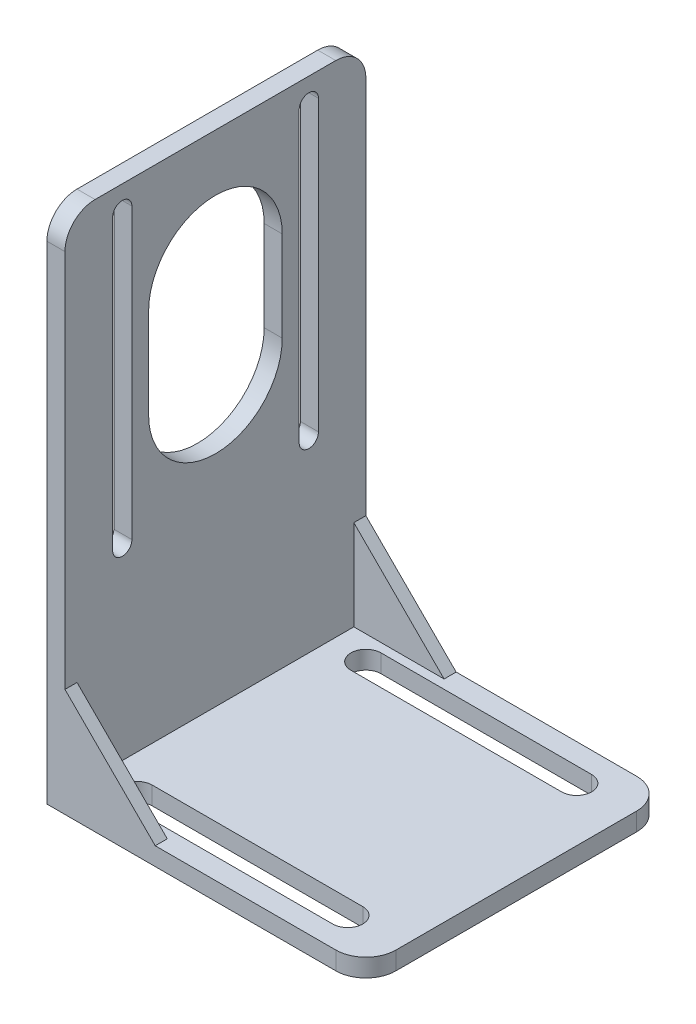
ISO-10303-21;
HEADER;
FILE_DESCRIPTION(('STEP AP214'),'2;1');
FILE_NAME('part.step','',(''),(''),'','','');
FILE_SCHEMA(('AUTOMOTIVE_DESIGN { 1 0 10303 214 1 1 1 1 }'));
ENDSEC;
DATA;
#1=APPLICATION_CONTEXT('core data for automotive mechanical design processes');
#2=APPLICATION_PROTOCOL_DEFINITION('international standard','automotive_design',2000,#1);
#3=PRODUCT_CONTEXT('',#1,'mechanical');
#4=PRODUCT('Part','Part','',(#3));
#5=PRODUCT_RELATED_PRODUCT_CATEGORY('part','',(#4));
#6=PRODUCT_DEFINITION_FORMATION('','',#4);
#7=PRODUCT_DEFINITION_CONTEXT('part definition',#1,'design');
#8=PRODUCT_DEFINITION('design','',#6,#7);
#9=PRODUCT_DEFINITION_SHAPE('','',#8);
#10=(LENGTH_UNIT() NAMED_UNIT(*) SI_UNIT(.MILLI.,.METRE.));
#11=(NAMED_UNIT(*) PLANE_ANGLE_UNIT() SI_UNIT($,.RADIAN.));
#12=(NAMED_UNIT(*) SI_UNIT($,.STERADIAN.) SOLID_ANGLE_UNIT());
#13=UNCERTAINTY_MEASURE_WITH_UNIT(LENGTH_MEASURE(1.E-05),#10,'distance_accuracy_value','');
#14=(GEOMETRIC_REPRESENTATION_CONTEXT(3) GLOBAL_UNCERTAINTY_ASSIGNED_CONTEXT((#13)) GLOBAL_UNIT_ASSIGNED_CONTEXT((#10,
#11,#12)) REPRESENTATION_CONTEXT('',''));
#15=CARTESIAN_POINT('',(0.,0.,0.));
#16=DIRECTION('',(0.,0.,1.));
#17=DIRECTION('',(1.,0.,0.));
#18=AXIS2_PLACEMENT_3D('',#15,#16,#17);
#19=CARTESIAN_POINT('',(26.5,3.,-25.));
#20=DIRECTION('',(-1.,0.,0.));
#21=DIRECTION('',(0.,0.,1.));
#22=AXIS2_PLACEMENT_3D('',#19,#20,#21);
#23=PLANE('',#22);
#24=DIRECTION('',(0.,0.,-1.));
#25=VECTOR('',#24,1.);
#26=CARTESIAN_POINT('',(26.5,3.,-25.));
#27=LINE('',#26,#25);
#28=CARTESIAN_POINT('',(26.5,3.,20.));
#29=VERTEX_POINT('',#28);
#30=CARTESIAN_POINT('',(26.5,3.,-20.));
#31=VERTEX_POINT('',#30);
#32=EDGE_CURVE('E505',#29,#31,#27,.T.);
#33=ORIENTED_EDGE('',*,*,#32,.F.);
#34=DIRECTION('',(0.,-1.,0.));
#35=VECTOR('',#34,1.);
#36=CARTESIAN_POINT('',(26.5,3.,20.));
#37=LINE('',#36,#35);
#38=CARTESIAN_POINT('',(26.5,0.,20.));
#39=VERTEX_POINT('',#38);
#40=EDGE_CURVE('E588',#29,#39,#37,.T.);
#41=ORIENTED_EDGE('',*,*,#40,.T.);
#42=DIRECTION('',(0.,0.,-1.));
#43=VECTOR('',#42,1.);
#44=CARTESIAN_POINT('',(26.5,0.,-25.));
#45=LINE('',#44,#43);
#46=CARTESIAN_POINT('',(26.5,0.,-20.));
#47=VERTEX_POINT('',#46);
#48=EDGE_CURVE('E453',#39,#47,#45,.T.);
#49=ORIENTED_EDGE('',*,*,#48,.T.);
#50=DIRECTION('',(0.,-1.,0.));
#51=VECTOR('',#50,1.);
#52=CARTESIAN_POINT('',(26.5,3.,-20.));
#53=LINE('',#52,#51);
#54=EDGE_CURVE('E585',#47,#31,#53,.F.);
#55=ORIENTED_EDGE('',*,*,#54,.T.);
#56=EDGE_LOOP('',(#33,#41,#49,#55));
#57=FACE_BOUND('',#56,.T.);
#58=ADVANCED_FACE('F39',(#57),#23,.F.);
#59=CARTESIAN_POINT('',(-26.5,3.,-25.));
#60=DIRECTION('',(0.,0.,1.));
#61=DIRECTION('',(1.,0.,0.));
#62=AXIS2_PLACEMENT_3D('',#59,#60,#61);
#63=PLANE('',#62);
#64=DIRECTION('',(-1.,0.,0.));
#65=VECTOR('',#64,1.);
#66=CARTESIAN_POINT('',(-26.5,3.,-25.));
#67=LINE('',#66,#65);
#68=CARTESIAN_POINT('',(21.5,3.,-25.));
#69=VERTEX_POINT('',#68);
#70=CARTESIAN_POINT('',(-8.5,3.,-25.));
#71=VERTEX_POINT('',#70);
#72=EDGE_CURVE('E509',#69,#71,#67,.T.);
#73=ORIENTED_EDGE('',*,*,#72,.F.);
#74=DIRECTION('',(0.,-1.,0.));
#75=VECTOR('',#74,1.);
#76=CARTESIAN_POINT('',(21.5,3.,-25.));
#77=LINE('',#76,#75);
#78=CARTESIAN_POINT('',(21.5,0.,-25.));
#79=VERTEX_POINT('',#78);
#80=EDGE_CURVE('E613',#69,#79,#77,.T.);
#81=ORIENTED_EDGE('',*,*,#80,.T.);
#82=DIRECTION('',(-1.,0.,0.));
#83=VECTOR('',#82,1.);
#84=CARTESIAN_POINT('',(-26.5,0.,-25.));
#85=LINE('',#84,#83);
#86=CARTESIAN_POINT('',(-26.5,0.,-25.));
#87=VERTEX_POINT('',#86);
#88=EDGE_CURVE('E521',#79,#87,#85,.T.);
#89=ORIENTED_EDGE('',*,*,#88,.T.);
#90=DIRECTION('',(0.,-1.,0.));
#91=VECTOR('',#90,1.);
#92=CARTESIAN_POINT('',(-26.5,3.,-25.));
#93=LINE('',#92,#91);
#94=CARTESIAN_POINT('',(-26.5,81.,-25.));
#95=VERTEX_POINT('',#94);
#96=EDGE_CURVE('E534',#95,#87,#93,.T.);
#97=ORIENTED_EDGE('',*,*,#96,.F.);
#98=DIRECTION('',(-1.,0.,0.));
#99=VECTOR('',#98,1.);
#100=CARTESIAN_POINT('',(-23.5,81.,-25.));
#101=LINE('',#100,#99);
#102=CARTESIAN_POINT('',(-23.5,81.,-25.));
#103=VERTEX_POINT('',#102);
#104=EDGE_CURVE('E610',#95,#103,#101,.F.);
#105=ORIENTED_EDGE('',*,*,#104,.T.);
#106=DIRECTION('',(0.,-1.,0.));
#107=VECTOR('',#106,1.);
#108=CARTESIAN_POINT('',(-23.5,86.,-25.));
#109=LINE('',#108,#107);
#110=CARTESIAN_POINT('',(-23.5,18.,-25.));
#111=VERTEX_POINT('',#110);
#112=EDGE_CURVE('E408',#103,#111,#109,.T.);
#113=ORIENTED_EDGE('',*,*,#112,.T.);
#114=DIRECTION('',(0.707106781186548,-0.707106781186547,0.));
#115=VECTOR('',#114,1.);
#116=CARTESIAN_POINT('',(-23.5,18.,-25.));
#117=LINE('',#116,#115);
#118=EDGE_CURVE('E270',#111,#71,#117,.T.);
#119=ORIENTED_EDGE('',*,*,#118,.T.);
#120=EDGE_LOOP('',(#73,#81,#89,#97,#105,#113,#119));
#121=FACE_BOUND('',#120,.T.);
#122=ADVANCED_FACE('F638',(#121),#63,.F.);
#123=CARTESIAN_POINT('',(-26.5,3.,-25.));
#124=DIRECTION('',(1.,0.,0.));
#125=DIRECTION('',(0.,0.,-1.));
#126=AXIS2_PLACEMENT_3D('',#123,#124,#125);
#127=PLANE('',#126);
#128=DIRECTION('',(0.,-1.,0.));
#129=VECTOR('',#128,1.);
#130=CARTESIAN_POINT('',(-26.5,82.,13.8787928605296));
#131=LINE('',#130,#129);
#132=CARTESIAN_POINT('',(-26.5,82.,13.8787928605296));
#133=VERTEX_POINT('',#132);
#134=CARTESIAN_POINT('',(-26.5,34.,13.8787928605296));
#135=VERTEX_POINT('',#134);
#136=EDGE_CURVE('E350',#133,#135,#131,.T.);
#137=ORIENTED_EDGE('',*,*,#136,.F.);
#138=CARTESIAN_POINT('',(-26.5,82.,15.4787928605296));
#139=DIRECTION('',(-1.,0.,0.));
#140=DIRECTION('',(0.,0.,1.));
#141=AXIS2_PLACEMENT_3D('',#138,#139,#140);
#142=CIRCLE('',#141,1.6);
#143=CARTESIAN_POINT('',(-26.5,82.,17.0787928605296));
#144=VERTEX_POINT('',#143);
#145=EDGE_CURVE('E315',#144,#133,#142,.T.);
#146=ORIENTED_EDGE('',*,*,#145,.F.);
#147=DIRECTION('',(0.,1.,0.));
#148=VECTOR('',#147,1.);
#149=CARTESIAN_POINT('',(-26.5,82.,17.0787928605296));
#150=LINE('',#149,#148);
#151=CARTESIAN_POINT('',(-26.5,34.,17.0787928605296));
#152=VERTEX_POINT('',#151);
#153=EDGE_CURVE('E358',#152,#144,#150,.T.);
#154=ORIENTED_EDGE('',*,*,#153,.F.);
#155=CARTESIAN_POINT('',(-26.5,34.,15.4787928605296));
#156=DIRECTION('',(-1.,0.,0.));
#157=DIRECTION('',(0.,0.,1.));
#158=AXIS2_PLACEMENT_3D('',#155,#156,#157);
#159=CIRCLE('',#158,1.6);
#160=EDGE_CURVE('E354',#135,#152,#159,.T.);
#161=ORIENTED_EDGE('',*,*,#160,.F.);
#162=EDGE_LOOP('',(#137,#146,#154,#161));
#163=FACE_BOUND('',#162,.T.);
#164=DIRECTION('',(0.,-1.,0.));
#165=VECTOR('',#164,1.);
#166=CARTESIAN_POINT('',(-26.5,82.,-17.1212071394704));
#167=LINE('',#166,#165);
#168=CARTESIAN_POINT('',(-26.5,82.,-17.1212071394704));
#169=VERTEX_POINT('',#168);
#170=CARTESIAN_POINT('',(-26.5,34.,-17.1212071394704));
#171=VERTEX_POINT('',#170);
#172=EDGE_CURVE('E321',#169,#171,#167,.T.);
#173=ORIENTED_EDGE('',*,*,#172,.F.);
#174=CARTESIAN_POINT('',(-26.5,82.,-15.5212071394704));
#175=DIRECTION('',(-1.,0.,0.));
#176=DIRECTION('',(0.,0.,1.));
#177=AXIS2_PLACEMENT_3D('',#174,#175,#176);
#178=CIRCLE('',#177,1.6);
#179=CARTESIAN_POINT('',(-26.5,82.,-13.9212071394704));
#180=VERTEX_POINT('',#179);
#181=EDGE_CURVE('E318',#180,#169,#178,.T.);
#182=ORIENTED_EDGE('',*,*,#181,.F.);
#183=DIRECTION('',(0.,1.,0.));
#184=VECTOR('',#183,1.);
#185=CARTESIAN_POINT('',(-26.5,82.,-13.9212071394704));
#186=LINE('',#185,#184);
#187=CARTESIAN_POINT('',(-26.5,34.,-13.9212071394704));
#188=VERTEX_POINT('',#187);
#189=EDGE_CURVE('E330',#188,#180,#186,.T.);
#190=ORIENTED_EDGE('',*,*,#189,.F.);
#191=CARTESIAN_POINT('',(-26.5,34.,-15.5212071394704));
#192=DIRECTION('',(-1.,0.,0.));
#193=DIRECTION('',(0.,0.,1.));
#194=AXIS2_PLACEMENT_3D('',#191,#192,#193);
#195=CIRCLE('',#194,1.6);
#196=EDGE_CURVE('E326',#171,#188,#195,.T.);
#197=ORIENTED_EDGE('',*,*,#196,.F.);
#198=EDGE_LOOP('',(#173,#182,#190,#197));
#199=FACE_BOUND('',#198,.T.);
#200=DIRECTION('',(0.,-1.,0.));
#201=VECTOR('',#200,1.);
#202=CARTESIAN_POINT('',(-26.5,65.5,-11.1));
#203=LINE('',#202,#201);
#204=CARTESIAN_POINT('',(-26.5,65.5,-11.1));
#205=VERTEX_POINT('',#204);
#206=CARTESIAN_POINT('',(-26.5,50.5,-11.1));
#207=VERTEX_POINT('',#206);
#208=EDGE_CURVE('E376',#205,#207,#203,.T.);
#209=ORIENTED_EDGE('',*,*,#208,.F.);
#210=CARTESIAN_POINT('',(-26.5,65.5,0.));
#211=DIRECTION('',(-1.,0.,0.));
#212=DIRECTION('',(0.,0.,1.));
#213=AXIS2_PLACEMENT_3D('',#210,#211,#212);
#214=CIRCLE('',#213,11.1);
#215=CARTESIAN_POINT('',(-26.5,65.5,11.1));
#216=VERTEX_POINT('',#215);
#217=EDGE_CURVE('E338',#216,#205,#214,.T.);
#218=ORIENTED_EDGE('',*,*,#217,.F.);
#219=DIRECTION('',(0.,1.,0.));
#220=VECTOR('',#219,1.);
#221=CARTESIAN_POINT('',(-26.5,65.5,11.1));
#222=LINE('',#221,#220);
#223=CARTESIAN_POINT('',(-26.5,50.5,11.1));
#224=VERTEX_POINT('',#223);
#225=EDGE_CURVE('E384',#224,#216,#222,.T.);
#226=ORIENTED_EDGE('',*,*,#225,.F.);
#227=CARTESIAN_POINT('',(-26.5,50.5,0.));
#228=DIRECTION('',(-1.,0.,0.));
#229=DIRECTION('',(0.,0.,1.));
#230=AXIS2_PLACEMENT_3D('',#227,#228,#229);
#231=CIRCLE('',#230,11.1);
#232=EDGE_CURVE('E380',#207,#224,#231,.T.);
#233=ORIENTED_EDGE('',*,*,#232,.F.);
#234=EDGE_LOOP('',(#209,#218,#226,#233));
#235=FACE_BOUND('',#234,.T.);
#236=DIRECTION('',(0.,-1.,0.));
#237=VECTOR('',#236,1.);
#238=CARTESIAN_POINT('',(-26.5,3.,25.));
#239=LINE('',#238,#237);
#240=CARTESIAN_POINT('',(-26.5,81.,25.));
#241=VERTEX_POINT('',#240);
#242=CARTESIAN_POINT('',(-26.5,0.,25.));
#243=VERTEX_POINT('',#242);
#244=EDGE_CURVE('E517',#241,#243,#239,.T.);
#245=ORIENTED_EDGE('',*,*,#244,.F.);
#246=CARTESIAN_POINT('',(-26.5,81.,20.));
#247=DIRECTION('',(1.,0.,0.));
#248=DIRECTION('',(0.,0.,-1.));
#249=AXIS2_PLACEMENT_3D('',#246,#247,#248);
#250=CIRCLE('',#249,5.);
#251=CARTESIAN_POINT('',(-26.5,86.,20.));
#252=VERTEX_POINT('',#251);
#253=EDGE_CURVE('E11',#241,#252,#250,.F.);
#254=ORIENTED_EDGE('',*,*,#253,.T.);
#255=DIRECTION('',(0.,0.,1.));
#256=VECTOR('',#255,1.);
#257=CARTESIAN_POINT('',(-26.5,86.,-25.));
#258=LINE('',#257,#256);
#259=CARTESIAN_POINT('',(-26.5,86.,-20.));
#260=VERTEX_POINT('',#259);
#261=EDGE_CURVE('E401',#260,#252,#258,.T.);
#262=ORIENTED_EDGE('',*,*,#261,.F.);
#263=CARTESIAN_POINT('',(-26.5,81.,-20.));
#264=DIRECTION('',(1.,0.,0.));
#265=DIRECTION('',(0.,0.,-1.));
#266=AXIS2_PLACEMENT_3D('',#263,#264,#265);
#267=CIRCLE('',#266,5.);
#268=EDGE_CURVE('E48',#260,#95,#267,.F.);
#269=ORIENTED_EDGE('',*,*,#268,.T.);
#270=ORIENTED_EDGE('',*,*,#96,.T.);
#271=DIRECTION('',(0.,0.,1.));
#272=VECTOR('',#271,1.);
#273=CARTESIAN_POINT('',(-26.5,0.,-25.));
#274=LINE('',#273,#272);
#275=EDGE_CURVE('E525',#87,#243,#274,.T.);
#276=ORIENTED_EDGE('',*,*,#275,.T.);
#277=EDGE_LOOP('',(#245,#254,#262,#269,#270,#276));
#278=FACE_BOUND('',#277,.T.);
#279=ADVANCED_FACE('F632',(#163,#199,#235,#278),#127,.F.);
#280=CARTESIAN_POINT('',(-26.5,3.,25.));
#281=DIRECTION('',(0.,0.,-1.));
#282=DIRECTION('',(-1.,0.,0.));
#283=AXIS2_PLACEMENT_3D('',#280,#281,#282);
#284=PLANE('',#283);
#285=DIRECTION('',(1.,0.,0.));
#286=VECTOR('',#285,1.);
#287=CARTESIAN_POINT('',(-26.5,0.,25.));
#288=LINE('',#287,#286);
#289=CARTESIAN_POINT('',(21.5,0.,25.));
#290=VERTEX_POINT('',#289);
#291=EDGE_CURVE('E510',#243,#290,#288,.T.);
#292=ORIENTED_EDGE('',*,*,#291,.T.);
#293=DIRECTION('',(0.,-1.,0.));
#294=VECTOR('',#293,1.);
#295=CARTESIAN_POINT('',(21.5,3.,25.));
#296=LINE('',#295,#294);
#297=CARTESIAN_POINT('',(21.5,3.,25.));
#298=VERTEX_POINT('',#297);
#299=EDGE_CURVE('E601',#290,#298,#296,.F.);
#300=ORIENTED_EDGE('',*,*,#299,.T.);
#301=DIRECTION('',(1.,0.,0.));
#302=VECTOR('',#301,1.);
#303=CARTESIAN_POINT('',(-26.5,3.,25.));
#304=LINE('',#303,#302);
#305=CARTESIAN_POINT('',(-8.5,3.,25.));
#306=VERTEX_POINT('',#305);
#307=EDGE_CURVE('E513',#306,#298,#304,.T.);
#308=ORIENTED_EDGE('',*,*,#307,.F.);
#309=DIRECTION('',(-0.707106781186547,0.707106781186548,0.));
#310=VECTOR('',#309,1.);
#311=CARTESIAN_POINT('',(-23.5,18.,25.));
#312=LINE('',#311,#310);
#313=CARTESIAN_POINT('',(-23.5,18.,25.));
#314=VERTEX_POINT('',#313);
#315=EDGE_CURVE('E295',#306,#314,#312,.T.);
#316=ORIENTED_EDGE('',*,*,#315,.T.);
#317=DIRECTION('',(0.,-1.,0.));
#318=VECTOR('',#317,1.);
#319=CARTESIAN_POINT('',(-23.5,86.,25.));
#320=LINE('',#319,#318);
#321=CARTESIAN_POINT('',(-23.5,81.,25.));
#322=VERTEX_POINT('',#321);
#323=EDGE_CURVE('E413',#322,#314,#320,.T.);
#324=ORIENTED_EDGE('',*,*,#323,.F.);
#325=DIRECTION('',(1.,0.,0.));
#326=VECTOR('',#325,1.);
#327=CARTESIAN_POINT('',(-26.5,81.,25.));
#328=LINE('',#327,#326);
#329=EDGE_CURVE('E598',#322,#241,#328,.F.);
#330=ORIENTED_EDGE('',*,*,#329,.T.);
#331=ORIENTED_EDGE('',*,*,#244,.T.);
#332=EDGE_LOOP('',(#292,#300,#308,#316,#324,#330,#331));
#333=FACE_BOUND('',#332,.T.);
#334=ADVANCED_FACE('F645',(#333),#284,.F.);
#335=CARTESIAN_POINT('',(0.,3.,0.));
#336=DIRECTION('',(0.,1.,0.));
#337=DIRECTION('',(0.,0.,1.));
#338=AXIS2_PLACEMENT_3D('',#335,#336,#337);
#339=PLANE('',#338);
#340=ORIENTED_EDGE('',*,*,#307,.T.);
#341=CARTESIAN_POINT('',(21.5,3.,20.));
#342=DIRECTION('',(0.,1.,0.));
#343=DIRECTION('',(0.,0.,1.));
#344=AXIS2_PLACEMENT_3D('',#341,#342,#343);
#345=CIRCLE('',#344,5.);
#346=EDGE_CURVE('E607',#298,#29,#345,.T.);
#347=ORIENTED_EDGE('',*,*,#346,.T.);
#348=ORIENTED_EDGE('',*,*,#32,.T.);
#349=CARTESIAN_POINT('',(21.5,3.,-20.));
#350=DIRECTION('',(0.,1.,0.));
#351=DIRECTION('',(0.,0.,1.));
#352=AXIS2_PLACEMENT_3D('',#349,#350,#351);
#353=CIRCLE('',#352,5.);
#354=EDGE_CURVE('E604',#31,#69,#353,.T.);
#355=ORIENTED_EDGE('',*,*,#354,.T.);
#356=ORIENTED_EDGE('',*,*,#72,.T.);
#357=DIRECTION('',(0.,0.,-1.));
#358=VECTOR('',#357,1.);
#359=CARTESIAN_POINT('',(-8.5,3.,-23.));
#360=LINE('',#359,#358);
#361=CARTESIAN_POINT('',(-8.5,3.,-23.));
#362=VERTEX_POINT('',#361);
#363=EDGE_CURVE('E273',#362,#71,#360,.T.);
#364=ORIENTED_EDGE('',*,*,#363,.F.);
#365=DIRECTION('',(-1.,0.,0.));
#366=VECTOR('',#365,1.);
#367=CARTESIAN_POINT('',(-8.5,3.,-23.));
#368=LINE('',#367,#366);
#369=CARTESIAN_POINT('',(-23.5,3.,-23.));
#370=VERTEX_POINT('',#369);
#371=EDGE_CURVE('E274',#362,#370,#368,.T.);
#372=ORIENTED_EDGE('',*,*,#371,.T.);
#373=DIRECTION('',(0.,0.,-1.));
#374=VECTOR('',#373,1.);
#375=CARTESIAN_POINT('',(-23.5,3.,-25.));
#376=LINE('',#375,#374);
#377=CARTESIAN_POINT('',(-23.5,3.,23.));
#378=VERTEX_POINT('',#377);
#379=EDGE_CURVE('E286',#378,#370,#376,.T.);
#380=ORIENTED_EDGE('',*,*,#379,.F.);
#381=DIRECTION('',(1.,0.,0.));
#382=VECTOR('',#381,1.);
#383=CARTESIAN_POINT('',(-23.5,3.,23.));
#384=LINE('',#383,#382);
#385=CARTESIAN_POINT('',(-8.5,3.,23.));
#386=VERTEX_POINT('',#385);
#387=EDGE_CURVE('E300',#378,#386,#384,.T.);
#388=ORIENTED_EDGE('',*,*,#387,.T.);
#389=DIRECTION('',(0.,0.,1.));
#390=VECTOR('',#389,1.);
#391=CARTESIAN_POINT('',(-8.5,3.,23.));
#392=LINE('',#391,#390);
#393=EDGE_CURVE('E307',#386,#306,#392,.T.);
#394=ORIENTED_EDGE('',*,*,#393,.T.);
#395=EDGE_LOOP('',(#340,#347,#348,#355,#356,#364,#372,#380,#388,#394));
#396=FACE_BOUND('',#395,.T.);
#397=CARTESIAN_POINT('',(-17.5,3.,-19.0141851039252));
#398=DIRECTION('',(0.,1.,0.));
#399=DIRECTION('',(0.,0.,1.));
#400=AXIS2_PLACEMENT_3D('',#397,#398,#399);
#401=CIRCLE('',#400,2.5);
#402=CARTESIAN_POINT('',(-17.5,3.,-21.5141851039252));
#403=VERTEX_POINT('',#402);
#404=CARTESIAN_POINT('',(-17.5,3.,-16.5141851039252));
#405=VERTEX_POINT('',#404);
#406=EDGE_CURVE('E435',#403,#405,#401,.T.);
#407=ORIENTED_EDGE('',*,*,#406,.F.);
#408=DIRECTION('',(-1.,0.,0.));
#409=VECTOR('',#408,1.);
#410=CARTESIAN_POINT('',(-17.5,3.,-21.5141851039252));
#411=LINE('',#410,#409);
#412=CARTESIAN_POINT('',(17.5,3.,-21.5141851039252));
#413=VERTEX_POINT('',#412);
#414=EDGE_CURVE('E422',#413,#403,#411,.T.);
#415=ORIENTED_EDGE('',*,*,#414,.F.);
#416=CARTESIAN_POINT('',(17.5,3.,-19.0141851039252));
#417=DIRECTION('',(0.,1.,0.));
#418=DIRECTION('',(0.,0.,1.));
#419=AXIS2_PLACEMENT_3D('',#416,#417,#418);
#420=CIRCLE('',#419,2.5);
#421=CARTESIAN_POINT('',(17.5,3.,-16.5141851039252));
#422=VERTEX_POINT('',#421);
#423=EDGE_CURVE('E443',#422,#413,#420,.T.);
#424=ORIENTED_EDGE('',*,*,#423,.F.);
#425=DIRECTION('',(1.,0.,0.));
#426=VECTOR('',#425,1.);
#427=CARTESIAN_POINT('',(-17.5,3.,-16.5141851039252));
#428=LINE('',#427,#426);
#429=EDGE_CURVE('E438',#405,#422,#428,.T.);
#430=ORIENTED_EDGE('',*,*,#429,.F.);
#431=EDGE_LOOP('',(#407,#415,#424,#430));
#432=FACE_BOUND('',#431,.T.);
#433=CARTESIAN_POINT('',(-17.5,3.,19.0141851039252));
#434=DIRECTION('',(0.,1.,0.));
#435=DIRECTION('',(0.,0.,-1.));
#436=AXIS2_PLACEMENT_3D('',#433,#434,#435);
#437=CIRCLE('',#436,2.5);
#438=CARTESIAN_POINT('',(-17.5,3.,16.5141851039252));
#439=VERTEX_POINT('',#438);
#440=CARTESIAN_POINT('',(-17.5,3.,21.5141851039252));
#441=VERTEX_POINT('',#440);
#442=EDGE_CURVE('E416',#439,#441,#437,.T.);
#443=ORIENTED_EDGE('',*,*,#442,.F.);
#444=DIRECTION('',(-1.,0.,0.));
#445=VECTOR('',#444,1.);
#446=CARTESIAN_POINT('',(-17.5,3.,16.5141851039252));
#447=LINE('',#446,#445);
#448=CARTESIAN_POINT('',(17.5,3.,16.5141851039252));
#449=VERTEX_POINT('',#448);
#450=EDGE_CURVE('E468',#449,#439,#447,.T.);
#451=ORIENTED_EDGE('',*,*,#450,.F.);
#452=CARTESIAN_POINT('',(17.5,3.,19.0141851039252));
#453=DIRECTION('',(0.,1.,0.));
#454=DIRECTION('',(0.,0.,-1.));
#455=AXIS2_PLACEMENT_3D('',#452,#453,#454);
#456=CIRCLE('',#455,2.5);
#457=CARTESIAN_POINT('',(17.5,3.,21.5141851039252));
#458=VERTEX_POINT('',#457);
#459=EDGE_CURVE('E487',#458,#449,#456,.T.);
#460=ORIENTED_EDGE('',*,*,#459,.F.);
#461=DIRECTION('',(1.,0.,0.));
#462=VECTOR('',#461,1.);
#463=CARTESIAN_POINT('',(-17.5,3.,21.5141851039252));
#464=LINE('',#463,#462);
#465=EDGE_CURVE('E483',#441,#458,#464,.T.);
#466=ORIENTED_EDGE('',*,*,#465,.F.);
#467=EDGE_LOOP('',(#443,#451,#460,#466));
#468=FACE_BOUND('',#467,.T.);
#469=ADVANCED_FACE('F659',(#396,#432,#468),#339,.T.);
#470=CARTESIAN_POINT('',(0.,0.,0.));
#471=DIRECTION('',(0.,1.,0.));
#472=DIRECTION('',(0.,0.,1.));
#473=AXIS2_PLACEMENT_3D('',#470,#471,#472);
#474=PLANE('',#473);
#475=DIRECTION('',(-1.,0.,0.));
#476=VECTOR('',#475,1.);
#477=CARTESIAN_POINT('',(-17.5,0.,-21.5141851039252));
#478=LINE('',#477,#476);
#479=CARTESIAN_POINT('',(17.5,0.,-21.5141851039252));
#480=VERTEX_POINT('',#479);
#481=CARTESIAN_POINT('',(-17.5,0.,-21.5141851039252));
#482=VERTEX_POINT('',#481);
#483=EDGE_CURVE('E430',#480,#482,#478,.T.);
#484=ORIENTED_EDGE('',*,*,#483,.T.);
#485=CARTESIAN_POINT('',(-17.5,0.,-19.0141851039252));
#486=DIRECTION('',(0.,1.,0.));
#487=DIRECTION('',(0.,0.,1.));
#488=AXIS2_PLACEMENT_3D('',#485,#486,#487);
#489=CIRCLE('',#488,2.5);
#490=CARTESIAN_POINT('',(-17.5,0.,-16.5141851039252));
#491=VERTEX_POINT('',#490);
#492=EDGE_CURVE('E417',#482,#491,#489,.T.);
#493=ORIENTED_EDGE('',*,*,#492,.T.);
#494=DIRECTION('',(1.,0.,0.));
#495=VECTOR('',#494,1.);
#496=CARTESIAN_POINT('',(-17.5,0.,-16.5141851039252));
#497=LINE('',#496,#495);
#498=CARTESIAN_POINT('',(17.5,0.,-16.5141851039252));
#499=VERTEX_POINT('',#498);
#500=EDGE_CURVE('E421',#491,#499,#497,.T.);
#501=ORIENTED_EDGE('',*,*,#500,.T.);
#502=CARTESIAN_POINT('',(17.5,0.,-19.0141851039252));
#503=DIRECTION('',(0.,1.,0.));
#504=DIRECTION('',(0.,0.,1.));
#505=AXIS2_PLACEMENT_3D('',#502,#503,#504);
#506=CIRCLE('',#505,2.5);
#507=EDGE_CURVE('E426',#499,#480,#506,.T.);
#508=ORIENTED_EDGE('',*,*,#507,.T.);
#509=EDGE_LOOP('',(#484,#493,#501,#508));
#510=FACE_BOUND('',#509,.T.);
#511=DIRECTION('',(-1.,0.,0.));
#512=VECTOR('',#511,1.);
#513=CARTESIAN_POINT('',(-17.5,0.,16.5141851039252));
#514=LINE('',#513,#512);
#515=CARTESIAN_POINT('',(17.5,0.,16.5141851039252));
#516=VERTEX_POINT('',#515);
#517=CARTESIAN_POINT('',(-17.5,0.,16.5141851039252));
#518=VERTEX_POINT('',#517);
#519=EDGE_CURVE('E476',#516,#518,#514,.T.);
#520=ORIENTED_EDGE('',*,*,#519,.T.);
#521=CARTESIAN_POINT('',(-17.5,0.,19.0141851039252));
#522=DIRECTION('',(0.,1.,0.));
#523=DIRECTION('',(0.,0.,-1.));
#524=AXIS2_PLACEMENT_3D('',#521,#522,#523);
#525=CIRCLE('',#524,2.5);
#526=CARTESIAN_POINT('',(-17.5,0.,21.5141851039252));
#527=VERTEX_POINT('',#526);
#528=EDGE_CURVE('E463',#518,#527,#525,.T.);
#529=ORIENTED_EDGE('',*,*,#528,.T.);
#530=DIRECTION('',(1.,0.,0.));
#531=VECTOR('',#530,1.);
#532=CARTESIAN_POINT('',(-17.5,0.,21.5141851039252));
#533=LINE('',#532,#531);
#534=CARTESIAN_POINT('',(17.5,0.,21.5141851039252));
#535=VERTEX_POINT('',#534);
#536=EDGE_CURVE('E467',#527,#535,#533,.T.);
#537=ORIENTED_EDGE('',*,*,#536,.T.);
#538=CARTESIAN_POINT('',(17.5,0.,19.0141851039252));
#539=DIRECTION('',(0.,1.,0.));
#540=DIRECTION('',(0.,0.,-1.));
#541=AXIS2_PLACEMENT_3D('',#538,#539,#540);
#542=CIRCLE('',#541,2.5);
#543=EDGE_CURVE('E472',#535,#516,#542,.T.);
#544=ORIENTED_EDGE('',*,*,#543,.T.);
#545=EDGE_LOOP('',(#520,#529,#537,#544));
#546=FACE_BOUND('',#545,.T.);
#547=ORIENTED_EDGE('',*,*,#48,.F.);
#548=CARTESIAN_POINT('',(21.5,0.,20.));
#549=DIRECTION('',(0.,1.,0.));
#550=DIRECTION('',(0.,0.,1.));
#551=AXIS2_PLACEMENT_3D('',#548,#549,#550);
#552=CIRCLE('',#551,5.);
#553=EDGE_CURVE('E595',#39,#290,#552,.F.);
#554=ORIENTED_EDGE('',*,*,#553,.T.);
#555=ORIENTED_EDGE('',*,*,#291,.F.);
#556=ORIENTED_EDGE('',*,*,#275,.F.);
#557=ORIENTED_EDGE('',*,*,#88,.F.);
#558=CARTESIAN_POINT('',(21.5,0.,-20.));
#559=DIRECTION('',(0.,1.,0.));
#560=DIRECTION('',(0.,0.,1.));
#561=AXIS2_PLACEMENT_3D('',#558,#559,#560);
#562=CIRCLE('',#561,5.);
#563=EDGE_CURVE('E592',#79,#47,#562,.F.);
#564=ORIENTED_EDGE('',*,*,#563,.T.);
#565=EDGE_LOOP('',(#547,#554,#555,#556,#557,#564));
#566=FACE_BOUND('',#565,.T.);
#567=ADVANCED_FACE('F668',(#510,#546,#566),#474,.F.);
#568=CARTESIAN_POINT('',(-17.5,0.,19.0141851039252));
#569=DIRECTION('',(0.,1.,0.));
#570=DIRECTION('',(0.,0.,1.));
#571=AXIS2_PLACEMENT_3D('',#568,#569,#570);
#572=CYLINDRICAL_SURFACE('',#571,2.5);
#573=ORIENTED_EDGE('',*,*,#442,.T.);
#574=DIRECTION('',(0.,1.,0.));
#575=VECTOR('',#574,1.);
#576=CARTESIAN_POINT('',(-17.5,0.,21.5141851039252));
#577=LINE('',#576,#575);
#578=EDGE_CURVE('E480',#527,#441,#577,.T.);
#579=ORIENTED_EDGE('',*,*,#578,.F.);
#580=ORIENTED_EDGE('',*,*,#528,.F.);
#581=DIRECTION('',(0.,1.,0.));
#582=VECTOR('',#581,1.);
#583=CARTESIAN_POINT('',(-17.5,0.,16.5141851039252));
#584=LINE('',#583,#582);
#585=EDGE_CURVE('E439',#518,#439,#584,.T.);
#586=ORIENTED_EDGE('',*,*,#585,.T.);
#587=EDGE_LOOP('',(#573,#579,#580,#586));
#588=FACE_BOUND('',#587,.T.);
#589=ADVANCED_FACE('F670',(#588),#572,.F.);
#590=CARTESIAN_POINT('',(-17.5,0.,16.5141851039252));
#591=DIRECTION('',(0.,0.,-1.));
#592=DIRECTION('',(-1.,0.,0.));
#593=AXIS2_PLACEMENT_3D('',#590,#591,#592);
#594=PLANE('',#593);
#595=ORIENTED_EDGE('',*,*,#450,.T.);
#596=ORIENTED_EDGE('',*,*,#585,.F.);
#597=ORIENTED_EDGE('',*,*,#519,.F.);
#598=DIRECTION('',(0.,1.,0.));
#599=VECTOR('',#598,1.);
#600=CARTESIAN_POINT('',(17.5,0.,16.5141851039252));
#601=LINE('',#600,#599);
#602=EDGE_CURVE('E496',#516,#449,#601,.T.);
#603=ORIENTED_EDGE('',*,*,#602,.T.);
#604=EDGE_LOOP('',(#595,#596,#597,#603));
#605=FACE_BOUND('',#604,.T.);
#606=ADVANCED_FACE('F677',(#605),#594,.F.);
#607=CARTESIAN_POINT('',(17.5,0.,19.0141851039252));
#608=DIRECTION('',(0.,1.,0.));
#609=DIRECTION('',(0.,0.,1.));
#610=AXIS2_PLACEMENT_3D('',#607,#608,#609);
#611=CYLINDRICAL_SURFACE('',#610,2.5);
#612=ORIENTED_EDGE('',*,*,#459,.T.);
#613=ORIENTED_EDGE('',*,*,#602,.F.);
#614=ORIENTED_EDGE('',*,*,#543,.F.);
#615=DIRECTION('',(0.,1.,0.));
#616=VECTOR('',#615,1.);
#617=CARTESIAN_POINT('',(17.5,0.,21.5141851039252));
#618=LINE('',#617,#616);
#619=EDGE_CURVE('E499',#535,#458,#618,.T.);
#620=ORIENTED_EDGE('',*,*,#619,.T.);
#621=EDGE_LOOP('',(#612,#613,#614,#620));
#622=FACE_BOUND('',#621,.T.);
#623=ADVANCED_FACE('F980',(#622),#611,.F.);
#624=CARTESIAN_POINT('',(-17.5,0.,21.5141851039252));
#625=DIRECTION('',(0.,0.,1.));
#626=DIRECTION('',(1.,0.,0.));
#627=AXIS2_PLACEMENT_3D('',#624,#625,#626);
#628=PLANE('',#627);
#629=ORIENTED_EDGE('',*,*,#465,.T.);
#630=ORIENTED_EDGE('',*,*,#619,.F.);
#631=ORIENTED_EDGE('',*,*,#536,.F.);
#632=ORIENTED_EDGE('',*,*,#578,.T.);
#633=EDGE_LOOP('',(#629,#630,#631,#632));
#634=FACE_BOUND('',#633,.T.);
#635=ADVANCED_FACE('F970',(#634),#628,.F.);
#636=CARTESIAN_POINT('',(-17.5,0.,-19.0141851039252));
#637=DIRECTION('',(0.,1.,0.));
#638=DIRECTION('',(0.,0.,1.));
#639=AXIS2_PLACEMENT_3D('',#636,#637,#638);
#640=CYLINDRICAL_SURFACE('',#639,2.5);
#641=ORIENTED_EDGE('',*,*,#406,.T.);
#642=DIRECTION('',(0.,1.,0.));
#643=VECTOR('',#642,1.);
#644=CARTESIAN_POINT('',(-17.5,0.,-16.5141851039252));
#645=LINE('',#644,#643);
#646=EDGE_CURVE('E434',#491,#405,#645,.T.);
#647=ORIENTED_EDGE('',*,*,#646,.F.);
#648=ORIENTED_EDGE('',*,*,#492,.F.);
#649=DIRECTION('',(0.,1.,0.));
#650=VECTOR('',#649,1.);
#651=CARTESIAN_POINT('',(-17.5,0.,-21.5141851039252));
#652=LINE('',#651,#650);
#653=EDGE_CURVE('E450',#482,#403,#652,.T.);
#654=ORIENTED_EDGE('',*,*,#653,.T.);
#655=EDGE_LOOP('',(#641,#647,#648,#654));
#656=FACE_BOUND('',#655,.T.);
#657=ADVANCED_FACE('F960',(#656),#640,.F.);
#658=CARTESIAN_POINT('',(-17.5,0.,-21.5141851039252));
#659=DIRECTION('',(0.,0.,-1.));
#660=DIRECTION('',(-1.,0.,0.));
#661=AXIS2_PLACEMENT_3D('',#658,#659,#660);
#662=PLANE('',#661);
#663=ORIENTED_EDGE('',*,*,#414,.T.);
#664=ORIENTED_EDGE('',*,*,#653,.F.);
#665=ORIENTED_EDGE('',*,*,#483,.F.);
#666=DIRECTION('',(0.,1.,0.));
#667=VECTOR('',#666,1.);
#668=CARTESIAN_POINT('',(17.5,0.,-21.5141851039252));
#669=LINE('',#668,#667);
#670=EDGE_CURVE('E454',#480,#413,#669,.T.);
#671=ORIENTED_EDGE('',*,*,#670,.T.);
#672=EDGE_LOOP('',(#663,#664,#665,#671));
#673=FACE_BOUND('',#672,.T.);
#674=ADVANCED_FACE('F950',(#673),#662,.F.);
#675=CARTESIAN_POINT('',(17.5,0.,-19.0141851039252));
#676=DIRECTION('',(0.,1.,0.));
#677=DIRECTION('',(0.,0.,1.));
#678=AXIS2_PLACEMENT_3D('',#675,#676,#677);
#679=CYLINDRICAL_SURFACE('',#678,2.5);
#680=ORIENTED_EDGE('',*,*,#423,.T.);
#681=ORIENTED_EDGE('',*,*,#670,.F.);
#682=ORIENTED_EDGE('',*,*,#507,.F.);
#683=DIRECTION('',(0.,1.,0.));
#684=VECTOR('',#683,1.);
#685=CARTESIAN_POINT('',(17.5,0.,-16.5141851039252));
#686=LINE('',#685,#684);
#687=EDGE_CURVE('E457',#499,#422,#686,.T.);
#688=ORIENTED_EDGE('',*,*,#687,.T.);
#689=EDGE_LOOP('',(#680,#681,#682,#688));
#690=FACE_BOUND('',#689,.T.);
#691=ADVANCED_FACE('F940',(#690),#679,.F.);
#692=CARTESIAN_POINT('',(-17.5,0.,-16.5141851039252));
#693=DIRECTION('',(0.,0.,1.));
#694=DIRECTION('',(1.,0.,0.));
#695=AXIS2_PLACEMENT_3D('',#692,#693,#694);
#696=PLANE('',#695);
#697=ORIENTED_EDGE('',*,*,#429,.T.);
#698=ORIENTED_EDGE('',*,*,#687,.F.);
#699=ORIENTED_EDGE('',*,*,#500,.F.);
#700=ORIENTED_EDGE('',*,*,#646,.T.);
#701=EDGE_LOOP('',(#697,#698,#699,#700));
#702=FACE_BOUND('',#701,.T.);
#703=ADVANCED_FACE('F737',(#702),#696,.F.);
#704=CARTESIAN_POINT('',(-23.5,86.,-25.));
#705=DIRECTION('',(-1.,0.,0.));
#706=DIRECTION('',(0.,0.,1.));
#707=AXIS2_PLACEMENT_3D('',#704,#705,#706);
#708=PLANE('',#707);
#709=DIRECTION('',(0.,1.,0.));
#710=VECTOR('',#709,1.);
#711=CARTESIAN_POINT('',(-23.5,86.,17.0787928605296));
#712=LINE('',#711,#710);
#713=CARTESIAN_POINT('',(-23.5,34.,17.0787928605296));
#714=VERTEX_POINT('',#713);
#715=CARTESIAN_POINT('',(-23.5,82.,17.0787928605296));
#716=VERTEX_POINT('',#715);
#717=EDGE_CURVE('E577',#714,#716,#712,.T.);
#718=ORIENTED_EDGE('',*,*,#717,.T.);
#719=CARTESIAN_POINT('',(-23.5,82.,15.4787928605296));
#720=DIRECTION('',(-1.,0.,0.));
#721=DIRECTION('',(0.,0.,1.));
#722=AXIS2_PLACEMENT_3D('',#719,#720,#721);
#723=CIRCLE('',#722,1.6);
#724=CARTESIAN_POINT('',(-23.5,82.,13.8787928605296));
#725=VERTEX_POINT('',#724);
#726=EDGE_CURVE('E581',#716,#725,#723,.T.);
#727=ORIENTED_EDGE('',*,*,#726,.T.);
#728=DIRECTION('',(0.,-1.,0.));
#729=VECTOR('',#728,1.);
#730=CARTESIAN_POINT('',(-23.5,86.,13.8787928605296));
#731=LINE('',#730,#729);
#732=CARTESIAN_POINT('',(-23.5,34.,13.8787928605296));
#733=VERTEX_POINT('',#732);
#734=EDGE_CURVE('E569',#725,#733,#731,.T.);
#735=ORIENTED_EDGE('',*,*,#734,.T.);
#736=CARTESIAN_POINT('',(-23.5,34.,15.4787928605296));
#737=DIRECTION('',(-1.,0.,0.));
#738=DIRECTION('',(0.,0.,1.));
#739=AXIS2_PLACEMENT_3D('',#736,#737,#738);
#740=CIRCLE('',#739,1.6);
#741=EDGE_CURVE('E573',#733,#714,#740,.T.);
#742=ORIENTED_EDGE('',*,*,#741,.T.);
#743=EDGE_LOOP('',(#718,#727,#735,#742));
#744=FACE_BOUND('',#743,.T.);
#745=DIRECTION('',(0.,1.,0.));
#746=VECTOR('',#745,1.);
#747=CARTESIAN_POINT('',(-23.5,86.,-13.9212071394704));
#748=LINE('',#747,#746);
#749=CARTESIAN_POINT('',(-23.5,34.,-13.9212071394704));
#750=VERTEX_POINT('',#749);
#751=CARTESIAN_POINT('',(-23.5,82.,-13.9212071394704));
#752=VERTEX_POINT('',#751);
#753=EDGE_CURVE('E561',#750,#752,#748,.T.);
#754=ORIENTED_EDGE('',*,*,#753,.T.);
#755=CARTESIAN_POINT('',(-23.5,82.,-15.5212071394704));
#756=DIRECTION('',(-1.,0.,0.));
#757=DIRECTION('',(0.,0.,1.));
#758=AXIS2_PLACEMENT_3D('',#755,#756,#757);
#759=CIRCLE('',#758,1.6);
#760=CARTESIAN_POINT('',(-23.5,82.,-17.1212071394704));
#761=VERTEX_POINT('',#760);
#762=EDGE_CURVE('E565',#752,#761,#759,.T.);
#763=ORIENTED_EDGE('',*,*,#762,.T.);
#764=DIRECTION('',(0.,-1.,0.));
#765=VECTOR('',#764,1.);
#766=CARTESIAN_POINT('',(-23.5,86.,-17.1212071394704));
#767=LINE('',#766,#765);
#768=CARTESIAN_POINT('',(-23.5,34.,-17.1212071394704));
#769=VERTEX_POINT('',#768);
#770=EDGE_CURVE('E553',#761,#769,#767,.T.);
#771=ORIENTED_EDGE('',*,*,#770,.T.);
#772=CARTESIAN_POINT('',(-23.5,34.,-15.5212071394704));
#773=DIRECTION('',(-1.,0.,0.));
#774=DIRECTION('',(0.,0.,1.));
#775=AXIS2_PLACEMENT_3D('',#772,#773,#774);
#776=CIRCLE('',#775,1.6);
#777=EDGE_CURVE('E557',#769,#750,#776,.T.);
#778=ORIENTED_EDGE('',*,*,#777,.T.);
#779=EDGE_LOOP('',(#754,#763,#771,#778));
#780=FACE_BOUND('',#779,.T.);
#781=DIRECTION('',(0.,1.,0.));
#782=VECTOR('',#781,1.);
#783=CARTESIAN_POINT('',(-23.5,86.,11.1));
#784=LINE('',#783,#782);
#785=CARTESIAN_POINT('',(-23.5,50.5,11.1));
#786=VERTEX_POINT('',#785);
#787=CARTESIAN_POINT('',(-23.5,65.5,11.1));
#788=VERTEX_POINT('',#787);
#789=EDGE_CURVE('E545',#786,#788,#784,.T.);
#790=ORIENTED_EDGE('',*,*,#789,.T.);
#791=CARTESIAN_POINT('',(-23.5,65.5,0.));
#792=DIRECTION('',(-1.,0.,0.));
#793=DIRECTION('',(0.,0.,1.));
#794=AXIS2_PLACEMENT_3D('',#791,#792,#793);
#795=CIRCLE('',#794,11.1);
#796=CARTESIAN_POINT('',(-23.5,65.5,-11.1));
#797=VERTEX_POINT('',#796);
#798=EDGE_CURVE('E549',#788,#797,#795,.T.);
#799=ORIENTED_EDGE('',*,*,#798,.T.);
#800=DIRECTION('',(0.,-1.,0.));
#801=VECTOR('',#800,1.);
#802=CARTESIAN_POINT('',(-23.5,86.,-11.1));
#803=LINE('',#802,#801);
#804=CARTESIAN_POINT('',(-23.5,50.5,-11.1));
#805=VERTEX_POINT('',#804);
#806=EDGE_CURVE('E537',#797,#805,#803,.T.);
#807=ORIENTED_EDGE('',*,*,#806,.T.);
#808=CARTESIAN_POINT('',(-23.5,50.5,0.));
#809=DIRECTION('',(-1.,0.,0.));
#810=DIRECTION('',(0.,0.,1.));
#811=AXIS2_PLACEMENT_3D('',#808,#809,#810);
#812=CIRCLE('',#811,11.1);
#813=EDGE_CURVE('E541',#805,#786,#812,.T.);
#814=ORIENTED_EDGE('',*,*,#813,.T.);
#815=EDGE_LOOP('',(#790,#799,#807,#814));
#816=FACE_BOUND('',#815,.T.);
#817=DIRECTION('',(0.,0.,-1.));
#818=VECTOR('',#817,1.);
#819=CARTESIAN_POINT('',(-23.5,86.,-25.));
#820=LINE('',#819,#818);
#821=CARTESIAN_POINT('',(-23.5,86.,20.));
#822=VERTEX_POINT('',#821);
#823=CARTESIAN_POINT('',(-23.5,86.,-20.));
#824=VERTEX_POINT('',#823);
#825=EDGE_CURVE('E405',#822,#824,#820,.T.);
#826=ORIENTED_EDGE('',*,*,#825,.F.);
#827=CARTESIAN_POINT('',(-23.5,81.,20.));
#828=DIRECTION('',(-1.,0.,0.));
#829=DIRECTION('',(0.,0.,1.));
#830=AXIS2_PLACEMENT_3D('',#827,#828,#829);
#831=CIRCLE('',#830,5.);
#832=EDGE_CURVE('E63',#822,#322,#831,.F.);
#833=ORIENTED_EDGE('',*,*,#832,.T.);
#834=ORIENTED_EDGE('',*,*,#323,.T.);
#835=DIRECTION('',(0.,0.,1.));
#836=VECTOR('',#835,1.);
#837=CARTESIAN_POINT('',(-23.5,18.,23.));
#838=LINE('',#837,#836);
#839=CARTESIAN_POINT('',(-23.5,18.,23.));
#840=VERTEX_POINT('',#839);
#841=EDGE_CURVE('E311',#840,#314,#838,.T.);
#842=ORIENTED_EDGE('',*,*,#841,.F.);
#843=DIRECTION('',(0.,-1.,0.));
#844=VECTOR('',#843,1.);
#845=CARTESIAN_POINT('',(-23.5,18.,23.));
#846=LINE('',#845,#844);
#847=EDGE_CURVE('E297',#840,#378,#846,.T.);
#848=ORIENTED_EDGE('',*,*,#847,.T.);
#849=ORIENTED_EDGE('',*,*,#379,.T.);
#850=DIRECTION('',(0.,1.,0.));
#851=VECTOR('',#850,1.);
#852=CARTESIAN_POINT('',(-23.5,3.,-23.));
#853=LINE('',#852,#851);
#854=CARTESIAN_POINT('',(-23.5,18.,-23.));
#855=VERTEX_POINT('',#854);
#856=EDGE_CURVE('E278',#370,#855,#853,.T.);
#857=ORIENTED_EDGE('',*,*,#856,.T.);
#858=DIRECTION('',(0.,0.,-1.));
#859=VECTOR('',#858,1.);
#860=CARTESIAN_POINT('',(-23.5,18.,-23.));
#861=LINE('',#860,#859);
#862=EDGE_CURVE('E263',#855,#111,#861,.T.);
#863=ORIENTED_EDGE('',*,*,#862,.T.);
#864=ORIENTED_EDGE('',*,*,#112,.F.);
#865=CARTESIAN_POINT('',(-23.5,81.,-20.));
#866=DIRECTION('',(-1.,0.,0.));
#867=DIRECTION('',(0.,0.,1.));
#868=AXIS2_PLACEMENT_3D('',#865,#866,#867);
#869=CIRCLE('',#868,5.);
#870=EDGE_CURVE('E55',#103,#824,#869,.F.);
#871=ORIENTED_EDGE('',*,*,#870,.T.);
#872=EDGE_LOOP('',(#826,#833,#834,#842,#848,#849,#857,#863,#864,#871));
#873=FACE_BOUND('',#872,.T.);
#874=ADVANCED_FACE('F284',(#744,#780,#816,#873),#708,.F.);
#875=CARTESIAN_POINT('',(0.,86.,0.));
#876=DIRECTION('',(0.,1.,0.));
#877=DIRECTION('',(0.,0.,1.));
#878=AXIS2_PLACEMENT_3D('',#875,#876,#877);
#879=PLANE('',#878);
#880=ORIENTED_EDGE('',*,*,#261,.T.);
#881=DIRECTION('',(1.,0.,0.));
#882=VECTOR('',#881,1.);
#883=CARTESIAN_POINT('',(-23.5,86.,20.));
#884=LINE('',#883,#882);
#885=EDGE_CURVE('E621',#252,#822,#884,.T.);
#886=ORIENTED_EDGE('',*,*,#885,.T.);
#887=ORIENTED_EDGE('',*,*,#825,.T.);
#888=DIRECTION('',(-1.,0.,0.));
#889=VECTOR('',#888,1.);
#890=CARTESIAN_POINT('',(-26.5,86.,-20.));
#891=LINE('',#890,#889);
#892=EDGE_CURVE('E617',#824,#260,#891,.T.);
#893=ORIENTED_EDGE('',*,*,#892,.T.);
#894=EDGE_LOOP('',(#880,#886,#887,#893));
#895=FACE_BOUND('',#894,.T.);
#896=ADVANCED_FACE('F642',(#895),#879,.T.);
#897=CARTESIAN_POINT('',(26.5,65.5,0.));
#898=DIRECTION('',(-1.,0.,0.));
#899=DIRECTION('',(0.,0.,1.));
#900=AXIS2_PLACEMENT_3D('',#897,#898,#899);
#901=CYLINDRICAL_SURFACE('',#900,11.1);
#902=DIRECTION('',(-1.,0.,0.));
#903=VECTOR('',#902,1.);
#904=CARTESIAN_POINT('',(26.5,65.5,11.1));
#905=LINE('',#904,#903);
#906=EDGE_CURVE('E389',#788,#216,#905,.T.);
#907=ORIENTED_EDGE('',*,*,#906,.T.);
#908=ORIENTED_EDGE('',*,*,#217,.T.);
#909=DIRECTION('',(-1.,0.,0.));
#910=VECTOR('',#909,1.);
#911=CARTESIAN_POINT('',(26.5,65.5,-11.1));
#912=LINE('',#911,#910);
#913=EDGE_CURVE('E388',#797,#205,#912,.T.);
#914=ORIENTED_EDGE('',*,*,#913,.F.);
#915=ORIENTED_EDGE('',*,*,#798,.F.);
#916=EDGE_LOOP('',(#907,#908,#914,#915));
#917=FACE_BOUND('',#916,.T.);
#918=ADVANCED_FACE('F727',(#917),#901,.F.);
#919=CARTESIAN_POINT('',(26.5,65.5,11.1));
#920=DIRECTION('',(0.,0.,1.));
#921=DIRECTION('',(0.,-1.,0.));
#922=AXIS2_PLACEMENT_3D('',#919,#920,#921);
#923=PLANE('',#922);
#924=DIRECTION('',(-1.,0.,0.));
#925=VECTOR('',#924,1.);
#926=CARTESIAN_POINT('',(26.5,50.5,11.1));
#927=LINE('',#926,#925);
#928=EDGE_CURVE('E392',#786,#224,#927,.T.);
#929=ORIENTED_EDGE('',*,*,#928,.T.);
#930=ORIENTED_EDGE('',*,*,#225,.T.);
#931=ORIENTED_EDGE('',*,*,#906,.F.);
#932=ORIENTED_EDGE('',*,*,#789,.F.);
#933=EDGE_LOOP('',(#929,#930,#931,#932));
#934=FACE_BOUND('',#933,.T.);
#935=ADVANCED_FACE('F915',(#934),#923,.F.);
#936=CARTESIAN_POINT('',(26.5,50.5,0.));
#937=DIRECTION('',(-1.,0.,0.));
#938=DIRECTION('',(0.,0.,1.));
#939=AXIS2_PLACEMENT_3D('',#936,#937,#938);
#940=CYLINDRICAL_SURFACE('',#939,11.1);
#941=DIRECTION('',(-1.,0.,0.));
#942=VECTOR('',#941,1.);
#943=CARTESIAN_POINT('',(26.5,50.5,-11.1));
#944=LINE('',#943,#942);
#945=EDGE_CURVE('E395',#805,#207,#944,.T.);
#946=ORIENTED_EDGE('',*,*,#945,.T.);
#947=ORIENTED_EDGE('',*,*,#232,.T.);
#948=ORIENTED_EDGE('',*,*,#928,.F.);
#949=ORIENTED_EDGE('',*,*,#813,.F.);
#950=EDGE_LOOP('',(#946,#947,#948,#949));
#951=FACE_BOUND('',#950,.T.);
#952=ADVANCED_FACE('F905',(#951),#940,.F.);
#953=CARTESIAN_POINT('',(26.5,65.5,-11.1));
#954=DIRECTION('',(0.,0.,-1.));
#955=DIRECTION('',(-1.,0.,0.));
#956=AXIS2_PLACEMENT_3D('',#953,#954,#955);
#957=PLANE('',#956);
#958=ORIENTED_EDGE('',*,*,#913,.T.);
#959=ORIENTED_EDGE('',*,*,#208,.T.);
#960=ORIENTED_EDGE('',*,*,#945,.F.);
#961=ORIENTED_EDGE('',*,*,#806,.F.);
#962=EDGE_LOOP('',(#958,#959,#960,#961));
#963=FACE_BOUND('',#962,.T.);
#964=ADVANCED_FACE('F895',(#963),#957,.F.);
#965=CARTESIAN_POINT('',(26.5,82.,-15.5212071394704));
#966=DIRECTION('',(-1.,0.,0.));
#967=DIRECTION('',(0.,0.,1.));
#968=AXIS2_PLACEMENT_3D('',#965,#966,#967);
#969=CYLINDRICAL_SURFACE('',#968,1.6);
#970=DIRECTION('',(-1.,0.,0.));
#971=VECTOR('',#970,1.);
#972=CARTESIAN_POINT('',(26.5,82.,-13.9212071394704));
#973=LINE('',#972,#971);
#974=EDGE_CURVE('E335',#752,#180,#973,.T.);
#975=ORIENTED_EDGE('',*,*,#974,.T.);
#976=ORIENTED_EDGE('',*,*,#181,.T.);
#977=DIRECTION('',(-1.,0.,0.));
#978=VECTOR('',#977,1.);
#979=CARTESIAN_POINT('',(26.5,82.,-17.1212071394704));
#980=LINE('',#979,#978);
#981=EDGE_CURVE('E334',#761,#169,#980,.T.);
#982=ORIENTED_EDGE('',*,*,#981,.F.);
#983=ORIENTED_EDGE('',*,*,#762,.F.);
#984=EDGE_LOOP('',(#975,#976,#982,#983));
#985=FACE_BOUND('',#984,.T.);
#986=ADVANCED_FACE('F885',(#985),#969,.F.);
#987=CARTESIAN_POINT('',(26.5,82.,-13.9212071394704));
#988=DIRECTION('',(0.,0.,1.));
#989=DIRECTION('',(1.,0.,0.));
#990=AXIS2_PLACEMENT_3D('',#987,#988,#989);
#991=PLANE('',#990);
#992=DIRECTION('',(-1.,0.,0.));
#993=VECTOR('',#992,1.);
#994=CARTESIAN_POINT('',(26.5,34.,-13.9212071394704));
#995=LINE('',#994,#993);
#996=EDGE_CURVE('E339',#750,#188,#995,.T.);
#997=ORIENTED_EDGE('',*,*,#996,.T.);
#998=ORIENTED_EDGE('',*,*,#189,.T.);
#999=ORIENTED_EDGE('',*,*,#974,.F.);
#1000=ORIENTED_EDGE('',*,*,#753,.F.);
#1001=EDGE_LOOP('',(#997,#998,#999,#1000));
#1002=FACE_BOUND('',#1001,.T.);
#1003=ADVANCED_FACE('F875',(#1002),#991,.F.);
#1004=CARTESIAN_POINT('',(26.5,34.,-15.5212071394704));
#1005=DIRECTION('',(-1.,0.,0.));
#1006=DIRECTION('',(0.,0.,1.));
#1007=AXIS2_PLACEMENT_3D('',#1004,#1005,#1006);
#1008=CYLINDRICAL_SURFACE('',#1007,1.6);
#1009=DIRECTION('',(-1.,0.,0.));
#1010=VECTOR('',#1009,1.);
#1011=CARTESIAN_POINT('',(26.5,34.,-17.1212071394704));
#1012=LINE('',#1011,#1010);
#1013=EDGE_CURVE('E342',#769,#171,#1012,.T.);
#1014=ORIENTED_EDGE('',*,*,#1013,.T.);
#1015=ORIENTED_EDGE('',*,*,#196,.T.);
#1016=ORIENTED_EDGE('',*,*,#996,.F.);
#1017=ORIENTED_EDGE('',*,*,#777,.F.);
#1018=EDGE_LOOP('',(#1014,#1015,#1016,#1017));
#1019=FACE_BOUND('',#1018,.T.);
#1020=ADVANCED_FACE('F865',(#1019),#1008,.F.);
#1021=CARTESIAN_POINT('',(26.5,82.,-17.1212071394704));
#1022=DIRECTION('',(0.,0.,-1.));
#1023=DIRECTION('',(0.,1.,0.));
#1024=AXIS2_PLACEMENT_3D('',#1021,#1022,#1023);
#1025=PLANE('',#1024);
#1026=ORIENTED_EDGE('',*,*,#981,.T.);
#1027=ORIENTED_EDGE('',*,*,#172,.T.);
#1028=ORIENTED_EDGE('',*,*,#1013,.F.);
#1029=ORIENTED_EDGE('',*,*,#770,.F.);
#1030=EDGE_LOOP('',(#1026,#1027,#1028,#1029));
#1031=FACE_BOUND('',#1030,.T.);
#1032=ADVANCED_FACE('F855',(#1031),#1025,.F.);
#1033=CARTESIAN_POINT('',(26.5,82.,15.4787928605296));
#1034=DIRECTION('',(-1.,0.,0.));
#1035=DIRECTION('',(0.,0.,1.));
#1036=AXIS2_PLACEMENT_3D('',#1033,#1034,#1035);
#1037=CYLINDRICAL_SURFACE('',#1036,1.6);
#1038=DIRECTION('',(-1.,0.,0.));
#1039=VECTOR('',#1038,1.);
#1040=CARTESIAN_POINT('',(26.5,82.,17.0787928605296));
#1041=LINE('',#1040,#1039);
#1042=EDGE_CURVE('E322',#716,#144,#1041,.T.);
#1043=ORIENTED_EDGE('',*,*,#1042,.T.);
#1044=ORIENTED_EDGE('',*,*,#145,.T.);
#1045=DIRECTION('',(-1.,0.,0.));
#1046=VECTOR('',#1045,1.);
#1047=CARTESIAN_POINT('',(26.5,82.,13.8787928605296));
#1048=LINE('',#1047,#1046);
#1049=EDGE_CURVE('E362',#725,#133,#1048,.T.);
#1050=ORIENTED_EDGE('',*,*,#1049,.F.);
#1051=ORIENTED_EDGE('',*,*,#726,.F.);
#1052=EDGE_LOOP('',(#1043,#1044,#1050,#1051));
#1053=FACE_BOUND('',#1052,.T.);
#1054=ADVANCED_FACE('F845',(#1053),#1037,.F.);
#1055=CARTESIAN_POINT('',(26.5,82.,17.0787928605296));
#1056=DIRECTION('',(0.,0.,1.));
#1057=DIRECTION('',(0.,-1.,0.));
#1058=AXIS2_PLACEMENT_3D('',#1055,#1056,#1057);
#1059=PLANE('',#1058);
#1060=DIRECTION('',(-1.,0.,0.));
#1061=VECTOR('',#1060,1.);
#1062=CARTESIAN_POINT('',(26.5,34.,17.0787928605296));
#1063=LINE('',#1062,#1061);
#1064=EDGE_CURVE('E365',#714,#152,#1063,.T.);
#1065=ORIENTED_EDGE('',*,*,#1064,.T.);
#1066=ORIENTED_EDGE('',*,*,#153,.T.);
#1067=ORIENTED_EDGE('',*,*,#1042,.F.);
#1068=ORIENTED_EDGE('',*,*,#717,.F.);
#1069=EDGE_LOOP('',(#1065,#1066,#1067,#1068));
#1070=FACE_BOUND('',#1069,.T.);
#1071=ADVANCED_FACE('F835',(#1070),#1059,.F.);
#1072=CARTESIAN_POINT('',(26.5,34.,15.4787928605296));
#1073=DIRECTION('',(-1.,0.,0.));
#1074=DIRECTION('',(0.,0.,1.));
#1075=AXIS2_PLACEMENT_3D('',#1072,#1073,#1074);
#1076=CYLINDRICAL_SURFACE('',#1075,1.6);
#1077=DIRECTION('',(-1.,0.,0.));
#1078=VECTOR('',#1077,1.);
#1079=CARTESIAN_POINT('',(26.5,34.,13.8787928605296));
#1080=LINE('',#1079,#1078);
#1081=EDGE_CURVE('E368',#733,#135,#1080,.T.);
#1082=ORIENTED_EDGE('',*,*,#1081,.T.);
#1083=ORIENTED_EDGE('',*,*,#160,.T.);
#1084=ORIENTED_EDGE('',*,*,#1064,.F.);
#1085=ORIENTED_EDGE('',*,*,#741,.F.);
#1086=EDGE_LOOP('',(#1082,#1083,#1084,#1085));
#1087=FACE_BOUND('',#1086,.T.);
#1088=ADVANCED_FACE('F825',(#1087),#1076,.F.);
#1089=CARTESIAN_POINT('',(26.5,82.,13.8787928605296));
#1090=DIRECTION('',(0.,0.,-1.));
#1091=DIRECTION('',(-1.,0.,0.));
#1092=AXIS2_PLACEMENT_3D('',#1089,#1090,#1091);
#1093=PLANE('',#1092);
#1094=ORIENTED_EDGE('',*,*,#1049,.T.);
#1095=ORIENTED_EDGE('',*,*,#136,.T.);
#1096=ORIENTED_EDGE('',*,*,#1081,.F.);
#1097=ORIENTED_EDGE('',*,*,#734,.F.);
#1098=EDGE_LOOP('',(#1094,#1095,#1096,#1097));
#1099=FACE_BOUND('',#1098,.T.);
#1100=ADVANCED_FACE('F816',(#1099),#1093,.F.);
#1101=CARTESIAN_POINT('',(-23.5,18.,23.));
#1102=DIRECTION('',(0.707106781186548,0.707106781186547,0.));
#1103=DIRECTION('',(-0.707106781186547,0.707106781186548,0.));
#1104=AXIS2_PLACEMENT_3D('',#1101,#1102,#1103);
#1105=PLANE('',#1104);
#1106=ORIENTED_EDGE('',*,*,#315,.F.);
#1107=ORIENTED_EDGE('',*,*,#393,.F.);
#1108=DIRECTION('',(-0.707106781186547,0.707106781186548,0.));
#1109=VECTOR('',#1108,1.);
#1110=CARTESIAN_POINT('',(-23.5,18.,23.));
#1111=LINE('',#1110,#1109);
#1112=EDGE_CURVE('E303',#386,#840,#1111,.T.);
#1113=ORIENTED_EDGE('',*,*,#1112,.T.);
#1114=ORIENTED_EDGE('',*,*,#841,.T.);
#1115=EDGE_LOOP('',(#1106,#1107,#1113,#1114));
#1116=FACE_BOUND('',#1115,.T.);
#1117=ADVANCED_FACE('F807',(#1116),#1105,.T.);
#1118=CARTESIAN_POINT('',(0.,0.,23.));
#1119=DIRECTION('',(0.,0.,1.));
#1120=DIRECTION('',(1.,0.,0.));
#1121=AXIS2_PLACEMENT_3D('',#1118,#1119,#1120);
#1122=PLANE('',#1121);
#1123=ORIENTED_EDGE('',*,*,#847,.F.);
#1124=ORIENTED_EDGE('',*,*,#1112,.F.);
#1125=ORIENTED_EDGE('',*,*,#387,.F.);
#1126=EDGE_LOOP('',(#1123,#1124,#1125));
#1127=FACE_BOUND('',#1126,.T.);
#1128=ADVANCED_FACE('F799',(#1127),#1122,.F.);
#1129=CARTESIAN_POINT('',(-23.5,18.,-23.));
#1130=DIRECTION('',(0.707106781186547,0.707106781186548,0.));
#1131=DIRECTION('',(-0.707106781186548,0.707106781186547,0.));
#1132=AXIS2_PLACEMENT_3D('',#1129,#1130,#1131);
#1133=PLANE('',#1132);
#1134=ORIENTED_EDGE('',*,*,#118,.F.);
#1135=ORIENTED_EDGE('',*,*,#862,.F.);
#1136=DIRECTION('',(0.707106781186548,-0.707106781186547,0.));
#1137=VECTOR('',#1136,1.);
#1138=CARTESIAN_POINT('',(-23.5,18.,-23.));
#1139=LINE('',#1138,#1137);
#1140=EDGE_CURVE('E267',#855,#362,#1139,.T.);
#1141=ORIENTED_EDGE('',*,*,#1140,.T.);
#1142=ORIENTED_EDGE('',*,*,#363,.T.);
#1143=EDGE_LOOP('',(#1134,#1135,#1141,#1142));
#1144=FACE_BOUND('',#1143,.T.);
#1145=ADVANCED_FACE('F265',(#1144),#1133,.T.);
#1146=CARTESIAN_POINT('',(0.,0.,-23.));
#1147=DIRECTION('',(0.,0.,1.));
#1148=DIRECTION('',(1.,0.,0.));
#1149=AXIS2_PLACEMENT_3D('',#1146,#1147,#1148);
#1150=PLANE('',#1149);
#1151=ORIENTED_EDGE('',*,*,#856,.F.);
#1152=ORIENTED_EDGE('',*,*,#371,.F.);
#1153=ORIENTED_EDGE('',*,*,#1140,.F.);
#1154=EDGE_LOOP('',(#1151,#1152,#1153));
#1155=FACE_BOUND('',#1154,.T.);
#1156=ADVANCED_FACE('F277',(#1155),#1150,.T.);
#1157=CARTESIAN_POINT('',(21.5,3.,20.));
#1158=DIRECTION('',(0.,-1.,0.));
#1159=DIRECTION('',(0.,0.,-1.));
#1160=AXIS2_PLACEMENT_3D('',#1157,#1158,#1159);
#1161=CYLINDRICAL_SURFACE('',#1160,5.);
#1162=ORIENTED_EDGE('',*,*,#346,.F.);
#1163=ORIENTED_EDGE('',*,*,#299,.F.);
#1164=ORIENTED_EDGE('',*,*,#553,.F.);
#1165=ORIENTED_EDGE('',*,*,#40,.F.);
#1166=EDGE_LOOP('',(#1162,#1163,#1164,#1165));
#1167=FACE_BOUND('',#1166,.T.);
#1168=ADVANCED_FACE('F655',(#1167),#1161,.T.);
#1169=CARTESIAN_POINT('',(21.5,3.,-20.));
#1170=DIRECTION('',(0.,-1.,0.));
#1171=DIRECTION('',(0.,0.,-1.));
#1172=AXIS2_PLACEMENT_3D('',#1169,#1170,#1171);
#1173=CYLINDRICAL_SURFACE('',#1172,5.);
#1174=ORIENTED_EDGE('',*,*,#354,.F.);
#1175=ORIENTED_EDGE('',*,*,#54,.F.);
#1176=ORIENTED_EDGE('',*,*,#563,.F.);
#1177=ORIENTED_EDGE('',*,*,#80,.F.);
#1178=EDGE_LOOP('',(#1174,#1175,#1176,#1177));
#1179=FACE_BOUND('',#1178,.T.);
#1180=ADVANCED_FACE('F666',(#1179),#1173,.T.);
#1181=CARTESIAN_POINT('',(0.,81.,20.));
#1182=DIRECTION('',(-1.,0.,0.));
#1183=DIRECTION('',(0.,0.,1.));
#1184=AXIS2_PLACEMENT_3D('',#1181,#1182,#1183);
#1185=CYLINDRICAL_SURFACE('',#1184,5.);
#1186=ORIENTED_EDGE('',*,*,#253,.F.);
#1187=ORIENTED_EDGE('',*,*,#329,.F.);
#1188=ORIENTED_EDGE('',*,*,#832,.F.);
#1189=ORIENTED_EDGE('',*,*,#885,.F.);
#1190=EDGE_LOOP('',(#1186,#1187,#1188,#1189));
#1191=FACE_BOUND('',#1190,.T.);
#1192=ADVANCED_FACE('F649',(#1191),#1185,.T.);
#1193=CARTESIAN_POINT('',(0.,81.,-20.));
#1194=DIRECTION('',(1.,0.,0.));
#1195=DIRECTION('',(0.,0.,-1.));
#1196=AXIS2_PLACEMENT_3D('',#1193,#1194,#1195);
#1197=CYLINDRICAL_SURFACE('',#1196,5.);
#1198=ORIENTED_EDGE('',*,*,#870,.F.);
#1199=ORIENTED_EDGE('',*,*,#104,.F.);
#1200=ORIENTED_EDGE('',*,*,#268,.F.);
#1201=ORIENTED_EDGE('',*,*,#892,.F.);
#1202=EDGE_LOOP('',(#1198,#1199,#1200,#1201));
#1203=FACE_BOUND('',#1202,.T.);
#1204=ADVANCED_FACE('F41',(#1203),#1197,.T.);
#1205=CLOSED_SHELL('',(#58,#122,#279,#334,#469,#567,#589,#606,#623,#635,#657,#674,#691,#703,
#874,#896,#918,#935,#952,#964,#986,#1003,#1020,#1032,#1054,#1071,#1088,#1100,#1117,#1128,#1145,
#1156,#1168,#1180,#1192,#1204));
#1206=MANIFOLD_SOLID_BREP('B2',#1205);
#1207=ADVANCED_BREP_SHAPE_REPRESENTATION('',(#18,#1206),#14);
#1208=SHAPE_DEFINITION_REPRESENTATION(#9,#1207);
ENDSEC;
END-ISO-10303-21;
